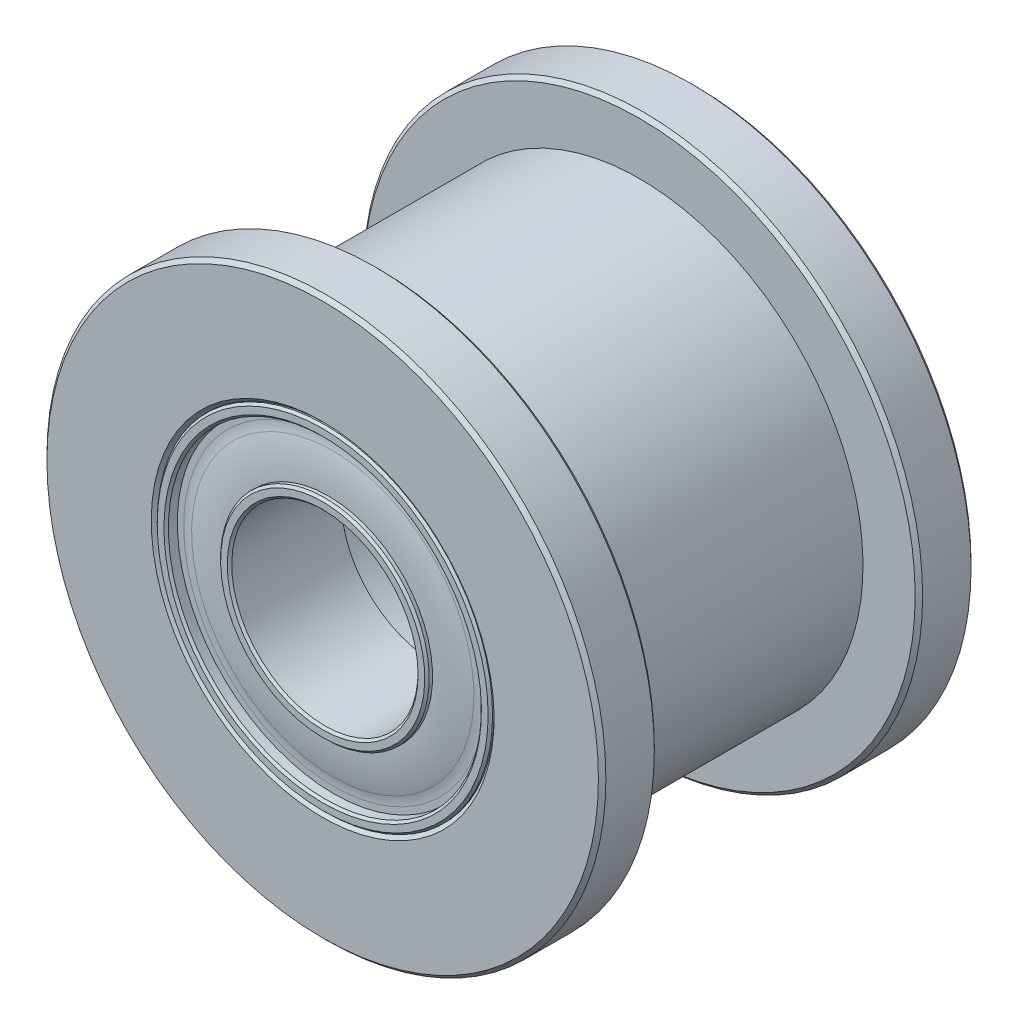
ISO-10303-21;
HEADER;
FILE_DESCRIPTION(('STEP AP214'),'2;1');
FILE_NAME('part.step','',(''),(''),'','','');
FILE_SCHEMA(('AUTOMOTIVE_DESIGN { 1 0 10303 214 1 1 1 1 }'));
ENDSEC;
DATA;
#1=APPLICATION_CONTEXT('core data for automotive mechanical design processes');
#2=APPLICATION_PROTOCOL_DEFINITION('international standard','automotive_design',2000,#1);
#3=PRODUCT_CONTEXT('',#1,'mechanical');
#4=PRODUCT('Part','Part','',(#3));
#5=PRODUCT_RELATED_PRODUCT_CATEGORY('part','',(#4));
#6=PRODUCT_DEFINITION_FORMATION('','',#4);
#7=PRODUCT_DEFINITION_CONTEXT('part definition',#1,'design');
#8=PRODUCT_DEFINITION('design','',#6,#7);
#9=PRODUCT_DEFINITION_SHAPE('','',#8);
#10=(LENGTH_UNIT() NAMED_UNIT(*) SI_UNIT(.MILLI.,.METRE.));
#11=(NAMED_UNIT(*) PLANE_ANGLE_UNIT() SI_UNIT($,.RADIAN.));
#12=(NAMED_UNIT(*) SI_UNIT($,.STERADIAN.) SOLID_ANGLE_UNIT());
#13=UNCERTAINTY_MEASURE_WITH_UNIT(LENGTH_MEASURE(1.E-05),#10,'distance_accuracy_value','');
#14=(GEOMETRIC_REPRESENTATION_CONTEXT(3) GLOBAL_UNCERTAINTY_ASSIGNED_CONTEXT((#13)) GLOBAL_UNIT_ASSIGNED_CONTEXT((#10,
#11,#12)) REPRESENTATION_CONTEXT('',''));
#15=CARTESIAN_POINT('',(0.,0.,0.));
#16=DIRECTION('',(0.,0.,1.));
#17=DIRECTION('',(1.,0.,0.));
#18=AXIS2_PLACEMENT_3D('',#15,#16,#17);
#19=CARTESIAN_POINT('',(0.,7.5,-3.5));
#20=DIRECTION('',(0.,0.,-1.));
#21=DIRECTION('',(0.,1.,0.));
#22=AXIS2_PLACEMENT_3D('',#19,#20,#21);
#23=PLANE('',#22);
#24=CARTESIAN_POINT('',(0.,0.,-3.5));
#25=DIRECTION('',(0.,0.,-1.));
#26=DIRECTION('',(0.,1.,0.));
#27=AXIS2_PLACEMENT_3D('',#24,#25,#26);
#28=CIRCLE('',#27,7.4);
#29=CARTESIAN_POINT('',(0.,7.4,-3.5));
#30=VERTEX_POINT('',#29);
#31=EDGE_CURVE('E88',#30,#30,#28,.F.);
#32=ORIENTED_EDGE('',*,*,#31,.T.);
#33=EDGE_LOOP('',(#32));
#34=FACE_BOUND('',#33,.T.);
#35=CARTESIAN_POINT('',(0.,0.,-3.5));
#36=DIRECTION('',(0.,0.,1.));
#37=DIRECTION('',(0.,-1.,0.));
#38=AXIS2_PLACEMENT_3D('',#35,#36,#37);
#39=CIRCLE('',#38,6.);
#40=CARTESIAN_POINT('',(0.,-6.,-3.5));
#41=VERTEX_POINT('',#40);
#42=EDGE_CURVE('E128',#41,#41,#39,.T.);
#43=ORIENTED_EDGE('',*,*,#42,.F.);
#44=EDGE_LOOP('',(#43));
#45=FACE_BOUND('',#44,.T.);
#46=ADVANCED_FACE('F52',(#34,#45),#23,.F.);
#47=CARTESIAN_POINT('',(0.,0.,5.));
#48=DIRECTION('',(0.,0.,1.));
#49=DIRECTION('',(0.,-1.,0.));
#50=AXIS2_PLACEMENT_3D('',#47,#48,#49);
#51=CYLINDRICAL_SURFACE('',#50,7.5);
#52=CARTESIAN_POINT('',(0.,0.,-4.9));
#53=DIRECTION('',(0.,0.,1.));
#54=DIRECTION('',(0.,-1.,0.));
#55=AXIS2_PLACEMENT_3D('',#52,#53,#54);
#56=CIRCLE('',#55,7.5);
#57=CARTESIAN_POINT('',(0.,-7.5,-4.9));
#58=VERTEX_POINT('',#57);
#59=EDGE_CURVE('E100',#58,#58,#56,.T.);
#60=ORIENTED_EDGE('',*,*,#59,.T.);
#61=EDGE_LOOP('',(#60));
#62=FACE_BOUND('',#61,.T.);
#63=CARTESIAN_POINT('',(0.,0.,-3.6));
#64=DIRECTION('',(0.,0.,-1.));
#65=DIRECTION('',(0.,1.,0.));
#66=AXIS2_PLACEMENT_3D('',#63,#64,#65);
#67=CIRCLE('',#66,7.5);
#68=CARTESIAN_POINT('',(0.,7.5,-3.6));
#69=VERTEX_POINT('',#68);
#70=EDGE_CURVE('E104',#69,#69,#67,.T.);
#71=ORIENTED_EDGE('',*,*,#70,.T.);
#72=EDGE_LOOP('',(#71));
#73=FACE_BOUND('',#72,.T.);
#74=ADVANCED_FACE('F136',(#62,#73),#51,.T.);
#75=CARTESIAN_POINT('',(0.,7.5,-5.));
#76=DIRECTION('',(0.,0.,1.));
#77=DIRECTION('',(0.,-1.,0.));
#78=AXIS2_PLACEMENT_3D('',#75,#76,#77);
#79=PLANE('',#78);
#80=CARTESIAN_POINT('',(0.,0.,-5.));
#81=DIRECTION('',(0.,0.,1.));
#82=DIRECTION('',(0.,-1.,0.));
#83=AXIS2_PLACEMENT_3D('',#80,#81,#82);
#84=CIRCLE('',#83,7.4);
#85=CARTESIAN_POINT('',(0.,-7.4,-5.));
#86=VERTEX_POINT('',#85);
#87=EDGE_CURVE('E92',#86,#86,#84,.F.);
#88=ORIENTED_EDGE('',*,*,#87,.T.);
#89=EDGE_LOOP('',(#88));
#90=FACE_BOUND('',#89,.T.);
#91=CARTESIAN_POINT('',(0.,0.,-5.));
#92=DIRECTION('',(0.,0.,1.));
#93=DIRECTION('',(0.,-1.,0.));
#94=AXIS2_PLACEMENT_3D('',#91,#92,#93);
#95=CIRCLE('',#94,4.6);
#96=CARTESIAN_POINT('',(0.,-4.6,-5.));
#97=VERTEX_POINT('',#96);
#98=EDGE_CURVE('E96',#97,#97,#95,.T.);
#99=ORIENTED_EDGE('',*,*,#98,.T.);
#100=EDGE_LOOP('',(#99));
#101=FACE_BOUND('',#100,.T.);
#102=ADVANCED_FACE('F143',(#90,#101),#79,.F.);
#103=CARTESIAN_POINT('',(0.,0.,5.));
#104=DIRECTION('',(0.,0.,1.));
#105=DIRECTION('',(0.,-1.,0.));
#106=AXIS2_PLACEMENT_3D('',#103,#104,#105);
#107=CYLINDRICAL_SURFACE('',#106,4.5);
#108=CARTESIAN_POINT('',(0.,0.,-4.9));
#109=DIRECTION('',(0.,0.,1.));
#110=DIRECTION('',(0.,-1.,0.));
#111=AXIS2_PLACEMENT_3D('',#108,#109,#110);
#112=CIRCLE('',#111,4.5);
#113=CARTESIAN_POINT('',(0.,-4.5,-4.9));
#114=VERTEX_POINT('',#113);
#115=EDGE_CURVE('E60',#114,#114,#112,.F.);
#116=ORIENTED_EDGE('',*,*,#115,.T.);
#117=EDGE_LOOP('',(#116));
#118=FACE_BOUND('',#117,.T.);
#119=CARTESIAN_POINT('',(0.,0.,-2.));
#120=DIRECTION('',(0.,0.,1.));
#121=DIRECTION('',(0.,-1.,0.));
#122=AXIS2_PLACEMENT_3D('',#119,#120,#121);
#123=CIRCLE('',#122,4.5);
#124=CARTESIAN_POINT('',(0.,-4.5,-2.));
#125=VERTEX_POINT('',#124);
#126=EDGE_CURVE('E108',#125,#125,#123,.T.);
#127=ORIENTED_EDGE('',*,*,#126,.T.);
#128=EDGE_LOOP('',(#127));
#129=FACE_BOUND('',#128,.T.);
#130=ADVANCED_FACE('F174',(#118,#129),#107,.F.);
#131=CARTESIAN_POINT('',(0.,3.5,-2.));
#132=DIRECTION('',(0.,0.,1.));
#133=DIRECTION('',(0.,-1.,0.));
#134=AXIS2_PLACEMENT_3D('',#131,#132,#133);
#135=PLANE('',#134);
#136=ORIENTED_EDGE('',*,*,#126,.F.);
#137=EDGE_LOOP('',(#136));
#138=FACE_BOUND('',#137,.T.);
#139=CARTESIAN_POINT('',(0.,0.,-2.));
#140=DIRECTION('',(0.,0.,1.));
#141=DIRECTION('',(0.,-1.,0.));
#142=AXIS2_PLACEMENT_3D('',#139,#140,#141);
#143=CIRCLE('',#142,3.5);
#144=CARTESIAN_POINT('',(0.,-3.5,-2.));
#145=VERTEX_POINT('',#144);
#146=EDGE_CURVE('E112',#145,#145,#143,.T.);
#147=ORIENTED_EDGE('',*,*,#146,.T.);
#148=EDGE_LOOP('',(#147));
#149=FACE_BOUND('',#148,.T.);
#150=ADVANCED_FACE('F179',(#138,#149),#135,.F.);
#151=CARTESIAN_POINT('',(0.,0.,5.));
#152=DIRECTION('',(0.,0.,1.));
#153=DIRECTION('',(0.,-1.,0.));
#154=AXIS2_PLACEMENT_3D('',#151,#152,#153);
#155=CYLINDRICAL_SURFACE('',#154,3.5);
#156=ORIENTED_EDGE('',*,*,#146,.F.);
#157=EDGE_LOOP('',(#156));
#158=FACE_BOUND('',#157,.T.);
#159=CARTESIAN_POINT('',(0.,0.,2.));
#160=DIRECTION('',(0.,0.,1.));
#161=DIRECTION('',(0.,-1.,0.));
#162=AXIS2_PLACEMENT_3D('',#159,#160,#161);
#163=CIRCLE('',#162,3.5);
#164=CARTESIAN_POINT('',(0.,-3.5,2.));
#165=VERTEX_POINT('',#164);
#166=EDGE_CURVE('E116',#165,#165,#163,.T.);
#167=ORIENTED_EDGE('',*,*,#166,.T.);
#168=EDGE_LOOP('',(#167));
#169=FACE_BOUND('',#168,.T.);
#170=ADVANCED_FACE('F184',(#158,#169),#155,.F.);
#171=CARTESIAN_POINT('',(0.,4.5,2.));
#172=DIRECTION('',(0.,0.,-1.));
#173=DIRECTION('',(0.,1.,0.));
#174=AXIS2_PLACEMENT_3D('',#171,#172,#173);
#175=PLANE('',#174);
#176=ORIENTED_EDGE('',*,*,#166,.F.);
#177=EDGE_LOOP('',(#176));
#178=FACE_BOUND('',#177,.T.);
#179=CARTESIAN_POINT('',(0.,0.,2.));
#180=DIRECTION('',(0.,0.,1.));
#181=DIRECTION('',(0.,-1.,0.));
#182=AXIS2_PLACEMENT_3D('',#179,#180,#181);
#183=CIRCLE('',#182,4.5);
#184=CARTESIAN_POINT('',(0.,-4.5,2.));
#185=VERTEX_POINT('',#184);
#186=EDGE_CURVE('E120',#185,#185,#183,.T.);
#187=ORIENTED_EDGE('',*,*,#186,.T.);
#188=EDGE_LOOP('',(#187));
#189=FACE_BOUND('',#188,.T.);
#190=ADVANCED_FACE('F188',(#178,#189),#175,.F.);
#191=CARTESIAN_POINT('',(0.,0.,5.));
#192=DIRECTION('',(0.,0.,1.));
#193=DIRECTION('',(0.,-1.,0.));
#194=AXIS2_PLACEMENT_3D('',#191,#192,#193);
#195=CYLINDRICAL_SURFACE('',#194,4.5);
#196=CARTESIAN_POINT('',(0.,0.,4.9));
#197=DIRECTION('',(0.,0.,-1.));
#198=DIRECTION('',(0.,1.,0.));
#199=AXIS2_PLACEMENT_3D('',#196,#197,#198);
#200=CIRCLE('',#199,4.5);
#201=CARTESIAN_POINT('',(0.,4.5,4.9));
#202=VERTEX_POINT('',#201);
#203=EDGE_CURVE('E11',#202,#202,#200,.F.);
#204=ORIENTED_EDGE('',*,*,#203,.T.);
#205=EDGE_LOOP('',(#204));
#206=FACE_BOUND('',#205,.T.);
#207=ORIENTED_EDGE('',*,*,#186,.F.);
#208=EDGE_LOOP('',(#207));
#209=FACE_BOUND('',#208,.T.);
#210=ADVANCED_FACE('F192',(#206,#209),#195,.F.);
#211=CARTESIAN_POINT('',(0.,7.5,5.));
#212=DIRECTION('',(0.,0.,-1.));
#213=DIRECTION('',(0.,1.,0.));
#214=AXIS2_PLACEMENT_3D('',#211,#212,#213);
#215=PLANE('',#214);
#216=CARTESIAN_POINT('',(0.,0.,5.));
#217=DIRECTION('',(0.,0.,-1.));
#218=DIRECTION('',(0.,1.,0.));
#219=AXIS2_PLACEMENT_3D('',#216,#217,#218);
#220=CIRCLE('',#219,7.4);
#221=CARTESIAN_POINT('',(0.,7.4,5.));
#222=VERTEX_POINT('',#221);
#223=EDGE_CURVE('E65',#222,#222,#220,.F.);
#224=ORIENTED_EDGE('',*,*,#223,.T.);
#225=EDGE_LOOP('',(#224));
#226=FACE_BOUND('',#225,.T.);
#227=CARTESIAN_POINT('',(0.,0.,5.));
#228=DIRECTION('',(0.,0.,-1.));
#229=DIRECTION('',(0.,1.,0.));
#230=AXIS2_PLACEMENT_3D('',#227,#228,#229);
#231=CIRCLE('',#230,4.6);
#232=CARTESIAN_POINT('',(0.,4.6,5.));
#233=VERTEX_POINT('',#232);
#234=EDGE_CURVE('E70',#233,#233,#231,.T.);
#235=ORIENTED_EDGE('',*,*,#234,.T.);
#236=EDGE_LOOP('',(#235));
#237=FACE_BOUND('',#236,.T.);
#238=ADVANCED_FACE('F196',(#226,#237),#215,.F.);
#239=CARTESIAN_POINT('',(0.,0.,5.));
#240=DIRECTION('',(0.,0.,1.));
#241=DIRECTION('',(0.,-1.,0.));
#242=AXIS2_PLACEMENT_3D('',#239,#240,#241);
#243=CYLINDRICAL_SURFACE('',#242,7.5);
#244=CARTESIAN_POINT('',(0.,0.,3.6));
#245=DIRECTION('',(0.,0.,1.));
#246=DIRECTION('',(0.,-1.,0.));
#247=AXIS2_PLACEMENT_3D('',#244,#245,#246);
#248=CIRCLE('',#247,7.5);
#249=CARTESIAN_POINT('',(0.,-7.5,3.6));
#250=VERTEX_POINT('',#249);
#251=EDGE_CURVE('E80',#250,#250,#248,.T.);
#252=ORIENTED_EDGE('',*,*,#251,.T.);
#253=EDGE_LOOP('',(#252));
#254=FACE_BOUND('',#253,.T.);
#255=CARTESIAN_POINT('',(0.,0.,4.9));
#256=DIRECTION('',(0.,0.,-1.));
#257=DIRECTION('',(0.,1.,0.));
#258=AXIS2_PLACEMENT_3D('',#255,#256,#257);
#259=CIRCLE('',#258,7.5);
#260=CARTESIAN_POINT('',(0.,7.5,4.9));
#261=VERTEX_POINT('',#260);
#262=EDGE_CURVE('E84',#261,#261,#259,.T.);
#263=ORIENTED_EDGE('',*,*,#262,.T.);
#264=EDGE_LOOP('',(#263));
#265=FACE_BOUND('',#264,.T.);
#266=ADVANCED_FACE('F199',(#254,#265),#243,.T.);
#267=CARTESIAN_POINT('',(0.,7.5,3.5));
#268=DIRECTION('',(0.,0.,1.));
#269=DIRECTION('',(0.,-1.,0.));
#270=AXIS2_PLACEMENT_3D('',#267,#268,#269);
#271=PLANE('',#270);
#272=CARTESIAN_POINT('',(0.,0.,3.5));
#273=DIRECTION('',(0.,0.,1.));
#274=DIRECTION('',(0.,-1.,0.));
#275=AXIS2_PLACEMENT_3D('',#272,#273,#274);
#276=CIRCLE('',#275,7.4);
#277=CARTESIAN_POINT('',(0.,-7.4,3.5));
#278=VERTEX_POINT('',#277);
#279=EDGE_CURVE('E76',#278,#278,#276,.F.);
#280=ORIENTED_EDGE('',*,*,#279,.T.);
#281=EDGE_LOOP('',(#280));
#282=FACE_BOUND('',#281,.T.);
#283=CARTESIAN_POINT('',(0.,0.,3.5));
#284=DIRECTION('',(0.,0.,1.));
#285=DIRECTION('',(0.,-1.,0.));
#286=AXIS2_PLACEMENT_3D('',#283,#284,#285);
#287=CIRCLE('',#286,6.);
#288=CARTESIAN_POINT('',(0.,-6.,3.5));
#289=VERTEX_POINT('',#288);
#290=EDGE_CURVE('E124',#289,#289,#287,.T.);
#291=ORIENTED_EDGE('',*,*,#290,.T.);
#292=EDGE_LOOP('',(#291));
#293=FACE_BOUND('',#292,.T.);
#294=ADVANCED_FACE('F203',(#282,#293),#271,.F.);
#295=CARTESIAN_POINT('',(0.,0.,5.));
#296=DIRECTION('',(0.,0.,1.));
#297=DIRECTION('',(0.,-1.,0.));
#298=AXIS2_PLACEMENT_3D('',#295,#296,#297);
#299=CYLINDRICAL_SURFACE('',#298,6.);
#300=ORIENTED_EDGE('',*,*,#290,.F.);
#301=EDGE_LOOP('',(#300));
#302=FACE_BOUND('',#301,.T.);
#303=ORIENTED_EDGE('',*,*,#42,.T.);
#304=EDGE_LOOP('',(#303));
#305=FACE_BOUND('',#304,.T.);
#306=ADVANCED_FACE('F133',(#302,#305),#299,.T.);
#307=CARTESIAN_POINT('',(0.,0.,-4.9));
#308=DIRECTION('',(0.,0.,1.));
#309=DIRECTION('',(0.,-1.,0.));
#310=AXIS2_PLACEMENT_3D('',#307,#308,#309);
#311=CONICAL_SURFACE('',#310,7.5,0.785398163397448);
#312=ORIENTED_EDGE('',*,*,#87,.F.);
#313=EDGE_LOOP('',(#312));
#314=FACE_BOUND('',#313,.T.);
#315=ORIENTED_EDGE('',*,*,#59,.F.);
#316=EDGE_LOOP('',(#315));
#317=FACE_BOUND('',#316,.T.);
#318=ADVANCED_FACE('F148',(#314,#317),#311,.T.);
#319=CARTESIAN_POINT('',(0.,0.,-3.5));
#320=DIRECTION('',(0.,0.,-1.));
#321=DIRECTION('',(0.,1.,0.));
#322=AXIS2_PLACEMENT_3D('',#319,#320,#321);
#323=CONICAL_SURFACE('',#322,7.4,0.785398163397457);
#324=ORIENTED_EDGE('',*,*,#70,.F.);
#325=EDGE_LOOP('',(#324));
#326=FACE_BOUND('',#325,.T.);
#327=ORIENTED_EDGE('',*,*,#31,.F.);
#328=EDGE_LOOP('',(#327));
#329=FACE_BOUND('',#328,.T.);
#330=ADVANCED_FACE('F151',(#326,#329),#323,.T.);
#331=CARTESIAN_POINT('',(0.,0.,3.6));
#332=DIRECTION('',(0.,0.,1.));
#333=DIRECTION('',(0.,-1.,0.));
#334=AXIS2_PLACEMENT_3D('',#331,#332,#333);
#335=CONICAL_SURFACE('',#334,7.5,0.785398163397453);
#336=ORIENTED_EDGE('',*,*,#279,.F.);
#337=EDGE_LOOP('',(#336));
#338=FACE_BOUND('',#337,.T.);
#339=ORIENTED_EDGE('',*,*,#251,.F.);
#340=EDGE_LOOP('',(#339));
#341=FACE_BOUND('',#340,.T.);
#342=ADVANCED_FACE('F155',(#338,#341),#335,.T.);
#343=CARTESIAN_POINT('',(0.,0.,5.));
#344=DIRECTION('',(0.,0.,-1.));
#345=DIRECTION('',(0.,1.,0.));
#346=AXIS2_PLACEMENT_3D('',#343,#344,#345);
#347=CONICAL_SURFACE('',#346,7.4,0.785398163397448);
#348=ORIENTED_EDGE('',*,*,#262,.F.);
#349=EDGE_LOOP('',(#348));
#350=FACE_BOUND('',#349,.T.);
#351=ORIENTED_EDGE('',*,*,#223,.F.);
#352=EDGE_LOOP('',(#351));
#353=FACE_BOUND('',#352,.T.);
#354=ADVANCED_FACE('F159',(#350,#353),#347,.T.);
#355=CARTESIAN_POINT('',(0.,0.,-5.));
#356=DIRECTION('',(0.,0.,-1.));
#357=DIRECTION('',(0.,1.,0.));
#358=AXIS2_PLACEMENT_3D('',#355,#356,#357);
#359=CONICAL_SURFACE('',#358,4.6,0.785398163397435);
#360=ORIENTED_EDGE('',*,*,#115,.F.);
#361=EDGE_LOOP('',(#360));
#362=FACE_BOUND('',#361,.T.);
#363=ORIENTED_EDGE('',*,*,#98,.F.);
#364=EDGE_LOOP('',(#363));
#365=FACE_BOUND('',#364,.T.);
#366=ADVANCED_FACE('F162',(#362,#365),#359,.F.);
#367=CARTESIAN_POINT('',(0.,0.,4.9));
#368=DIRECTION('',(0.,0.,1.));
#369=DIRECTION('',(0.,-1.,0.));
#370=AXIS2_PLACEMENT_3D('',#367,#368,#369);
#371=CONICAL_SURFACE('',#370,4.5,0.78539816339744);
#372=ORIENTED_EDGE('',*,*,#234,.F.);
#373=EDGE_LOOP('',(#372));
#374=FACE_BOUND('',#373,.T.);
#375=ORIENTED_EDGE('',*,*,#203,.F.);
#376=EDGE_LOOP('',(#375));
#377=FACE_BOUND('',#376,.T.);
#378=ADVANCED_FACE('F54',(#374,#377),#371,.F.);
#379=CLOSED_SHELL('',(#46,#74,#102,#130,#150,#170,#190,#210,#238,#266,#294,#306,#318,#330,#342,
#354,#366,#378));
#380=MANIFOLD_SOLID_BREP('B2',#379);
#381=CARTESIAN_POINT('',(0.,2.5,5.));
#382=DIRECTION('',(0.,0.,-1.));
#383=DIRECTION('',(0.,-1.,0.));
#384=AXIS2_PLACEMENT_3D('',#381,#382,#383);
#385=PLANE('',#384);
#386=CARTESIAN_POINT('',(0.,0.,5.));
#387=DIRECTION('',(0.,0.,1.));
#388=DIRECTION('',(0.,-1.,0.));
#389=AXIS2_PLACEMENT_3D('',#386,#387,#388);
#390=CIRCLE('',#389,2.74);
#391=CARTESIAN_POINT('',(0.,-2.74,5.));
#392=VERTEX_POINT('',#391);
#393=EDGE_CURVE('E342',#392,#392,#390,.F.);
#394=ORIENTED_EDGE('',*,*,#393,.F.);
#395=EDGE_LOOP('',(#394));
#396=FACE_BOUND('',#395,.T.);
#397=CARTESIAN_POINT('',(0.,0.,5.));
#398=DIRECTION('',(0.,0.,1.));
#399=DIRECTION('',(0.,-1.,0.));
#400=AXIS2_PLACEMENT_3D('',#397,#398,#399);
#401=CIRCLE('',#400,2.56);
#402=CARTESIAN_POINT('',(0.,-2.56,5.));
#403=VERTEX_POINT('',#402);
#404=EDGE_CURVE('E345',#403,#403,#401,.T.);
#405=ORIENTED_EDGE('',*,*,#404,.F.);
#406=EDGE_LOOP('',(#405));
#407=FACE_BOUND('',#406,.T.);
#408=ADVANCED_FACE('F313',(#396,#407),#385,.F.);
#409=CARTESIAN_POINT('',(0.,0.,-5.));
#410=DIRECTION('',(0.,0.,-1.));
#411=DIRECTION('',(0.,-1.,0.));
#412=AXIS2_PLACEMENT_3D('',#409,#410,#411);
#413=CYLINDRICAL_SURFACE('',#412,2.5);
#414=CARTESIAN_POINT('',(0.,0.,4.94));
#415=DIRECTION('',(0.,0.,1.));
#416=DIRECTION('',(0.,-1.,0.));
#417=AXIS2_PLACEMENT_3D('',#414,#415,#416);
#418=CIRCLE('',#417,2.5);
#419=CARTESIAN_POINT('',(0.,-2.5,4.94));
#420=VERTEX_POINT('',#419);
#421=EDGE_CURVE('E339',#420,#420,#418,.F.);
#422=ORIENTED_EDGE('',*,*,#421,.F.);
#423=EDGE_LOOP('',(#422));
#424=FACE_BOUND('',#423,.T.);
#425=CARTESIAN_POINT('',(0.,0.,2.));
#426=DIRECTION('',(0.,0.,1.));
#427=DIRECTION('',(0.,-1.,0.));
#428=AXIS2_PLACEMENT_3D('',#425,#426,#427);
#429=CIRCLE('',#428,2.5);
#430=CARTESIAN_POINT('',(0.,-2.5,2.));
#431=VERTEX_POINT('',#430);
#432=EDGE_CURVE('E351',#431,#431,#429,.T.);
#433=ORIENTED_EDGE('',*,*,#432,.F.);
#434=EDGE_LOOP('',(#433));
#435=FACE_BOUND('',#434,.T.);
#436=ADVANCED_FACE('F382',(#424,#435),#413,.F.);
#437=CARTESIAN_POINT('',(0.,4.5,2.));
#438=DIRECTION('',(0.,0.,1.));
#439=DIRECTION('',(0.,1.,0.));
#440=AXIS2_PLACEMENT_3D('',#437,#438,#439);
#441=PLANE('',#440);
#442=ORIENTED_EDGE('',*,*,#432,.T.);
#443=EDGE_LOOP('',(#442));
#444=FACE_BOUND('',#443,.T.);
#445=CARTESIAN_POINT('',(0.,0.,2.));
#446=DIRECTION('',(0.,0.,1.));
#447=DIRECTION('',(0.,-1.,0.));
#448=AXIS2_PLACEMENT_3D('',#445,#446,#447);
#449=CIRCLE('',#448,4.5);
#450=CARTESIAN_POINT('',(0.,-4.5,2.));
#451=VERTEX_POINT('',#450);
#452=EDGE_CURVE('E354',#451,#451,#449,.T.);
#453=ORIENTED_EDGE('',*,*,#452,.F.);
#454=EDGE_LOOP('',(#453));
#455=FACE_BOUND('',#454,.T.);
#456=ADVANCED_FACE('F388',(#444,#455),#441,.F.);
#457=CARTESIAN_POINT('',(0.,0.,-5.));
#458=DIRECTION('',(0.,0.,-1.));
#459=DIRECTION('',(0.,-1.,0.));
#460=AXIS2_PLACEMENT_3D('',#457,#458,#459);
#461=CYLINDRICAL_SURFACE('',#460,4.5);
#462=CARTESIAN_POINT('',(0.,0.,4.94));
#463=DIRECTION('',(0.,0.,1.));
#464=DIRECTION('',(0.,-1.,0.));
#465=AXIS2_PLACEMENT_3D('',#462,#463,#464);
#466=CIRCLE('',#465,4.5);
#467=CARTESIAN_POINT('',(0.,-4.5,4.94));
#468=VERTEX_POINT('',#467);
#469=EDGE_CURVE('E324',#468,#468,#466,.T.);
#470=ORIENTED_EDGE('',*,*,#469,.F.);
#471=EDGE_LOOP('',(#470));
#472=FACE_BOUND('',#471,.T.);
#473=ORIENTED_EDGE('',*,*,#452,.T.);
#474=EDGE_LOOP('',(#473));
#475=FACE_BOUND('',#474,.T.);
#476=ADVANCED_FACE('F415',(#472,#475),#461,.T.);
#477=CARTESIAN_POINT('',(0.,4.5,5.));
#478=DIRECTION('',(0.,0.,-1.));
#479=DIRECTION('',(0.,-1.,0.));
#480=AXIS2_PLACEMENT_3D('',#477,#478,#479);
#481=PLANE('',#480);
#482=CARTESIAN_POINT('',(0.,0.,5.));
#483=DIRECTION('',(0.,0.,1.));
#484=DIRECTION('',(0.,-1.,0.));
#485=AXIS2_PLACEMENT_3D('',#482,#483,#484);
#486=CIRCLE('',#485,4.26);
#487=CARTESIAN_POINT('',(0.,-4.26,5.));
#488=VERTEX_POINT('',#487);
#489=EDGE_CURVE('E333',#488,#488,#486,.T.);
#490=ORIENTED_EDGE('',*,*,#489,.F.);
#491=EDGE_LOOP('',(#490));
#492=FACE_BOUND('',#491,.T.);
#493=CARTESIAN_POINT('',(0.,0.,5.));
#494=DIRECTION('',(0.,0.,1.));
#495=DIRECTION('',(0.,-1.,0.));
#496=AXIS2_PLACEMENT_3D('',#493,#494,#495);
#497=CIRCLE('',#496,4.44);
#498=CARTESIAN_POINT('',(0.,-4.44,5.));
#499=VERTEX_POINT('',#498);
#500=EDGE_CURVE('E336',#499,#499,#497,.F.);
#501=ORIENTED_EDGE('',*,*,#500,.F.);
#502=EDGE_LOOP('',(#501));
#503=FACE_BOUND('',#502,.T.);
#504=ADVANCED_FACE('F418',(#492,#503),#481,.F.);
#505=CARTESIAN_POINT('',(0.,0.,-5.));
#506=DIRECTION('',(0.,0.,-1.));
#507=DIRECTION('',(0.,-1.,0.));
#508=AXIS2_PLACEMENT_3D('',#505,#506,#507);
#509=CYLINDRICAL_SURFACE('',#508,4.2);
#510=CARTESIAN_POINT('',(0.,0.,4.94));
#511=DIRECTION('',(0.,0.,1.));
#512=DIRECTION('',(0.,-1.,0.));
#513=AXIS2_PLACEMENT_3D('',#510,#511,#512);
#514=CIRCLE('',#513,4.2);
#515=CARTESIAN_POINT('',(0.,-4.2,4.94));
#516=VERTEX_POINT('',#515);
#517=EDGE_CURVE('E328',#516,#516,#514,.F.);
#518=ORIENTED_EDGE('',*,*,#517,.F.);
#519=EDGE_LOOP('',(#518));
#520=FACE_BOUND('',#519,.T.);
#521=CARTESIAN_POINT('',(0.,0.,4.7));
#522=DIRECTION('',(0.,0.,1.));
#523=DIRECTION('',(0.,-1.,0.));
#524=AXIS2_PLACEMENT_3D('',#521,#522,#523);
#525=CIRCLE('',#524,4.2);
#526=CARTESIAN_POINT('',(0.,-4.2,4.7));
#527=VERTEX_POINT('',#526);
#528=EDGE_CURVE('E357',#527,#527,#525,.T.);
#529=ORIENTED_EDGE('',*,*,#528,.F.);
#530=EDGE_LOOP('',(#529));
#531=FACE_BOUND('',#530,.T.);
#532=ADVANCED_FACE('F378',(#520,#531),#509,.F.);
#533=CARTESIAN_POINT('',(0.,3.9,4.7));
#534=DIRECTION('',(0.,0.,-1.));
#535=DIRECTION('',(0.,-1.,0.));
#536=AXIS2_PLACEMENT_3D('',#533,#534,#535);
#537=PLANE('',#536);
#538=CARTESIAN_POINT('',(0.,0.,4.7));
#539=DIRECTION('',(0.,0.,1.));
#540=DIRECTION('',(0.,-1.,0.));
#541=AXIS2_PLACEMENT_3D('',#538,#539,#540);
#542=CIRCLE('',#541,4.02882057274445);
#543=CARTESIAN_POINT('',(0.,-4.02882057274445,4.7));
#544=VERTEX_POINT('',#543);
#545=EDGE_CURVE('E320',#544,#544,#542,.T.);
#546=ORIENTED_EDGE('',*,*,#545,.F.);
#547=EDGE_LOOP('',(#546));
#548=FACE_BOUND('',#547,.T.);
#549=ORIENTED_EDGE('',*,*,#528,.T.);
#550=EDGE_LOOP('',(#549));
#551=FACE_BOUND('',#550,.T.);
#552=ADVANCED_FACE('F368',(#548,#551),#537,.F.);
#553=CARTESIAN_POINT('',(0.,0.,0.741666666666619));
#554=DIRECTION('',(0.,0.,-1.));
#555=DIRECTION('',(0.,-1.,0.));
#556=AXIS2_PLACEMENT_3D('',#553,#554,#555);
#557=DEGENERATE_TOROIDAL_SURFACE('',#556,2.8,4.10833333333338,.T.);
#558=CARTESIAN_POINT('',(0.,0.,4.72936378466557));
#559=DIRECTION('',(0.,0.,1.));
#560=DIRECTION('',(0.,-1.,0.));
#561=AXIS2_PLACEMENT_3D('',#558,#559,#560);
#562=CIRCLE('',#561,3.78826842147311);
#563=CARTESIAN_POINT('',(0.,-3.78826842147311,4.72936378466557));
#564=VERTEX_POINT('',#563);
#565=EDGE_CURVE('E51',#564,#564,#562,.F.);
#566=ORIENTED_EDGE('',*,*,#565,.F.);
#567=EDGE_LOOP('',(#566));
#568=FACE_BOUND('',#567,.T.);
#569=CARTESIAN_POINT('',(0.,0.,4.85));
#570=DIRECTION('',(0.,0.,1.));
#571=DIRECTION('',(0.,-1.,0.));
#572=AXIS2_PLACEMENT_3D('',#569,#570,#571);
#573=CIRCLE('',#572,2.8);
#574=CARTESIAN_POINT('',(0.,-2.8,4.85));
#575=VERTEX_POINT('',#574);
#576=EDGE_CURVE('E360',#575,#575,#573,.T.);
#577=ORIENTED_EDGE('',*,*,#576,.F.);
#578=EDGE_LOOP('',(#577));
#579=FACE_BOUND('',#578,.T.);
#580=ADVANCED_FACE('F366',(#568,#579),#557,.T.);
#581=CARTESIAN_POINT('',(0.,0.,-5.));
#582=DIRECTION('',(0.,0.,-1.));
#583=DIRECTION('',(0.,-1.,0.));
#584=AXIS2_PLACEMENT_3D('',#581,#582,#583);
#585=CYLINDRICAL_SURFACE('',#584,2.8);
#586=CARTESIAN_POINT('',(0.,0.,4.94));
#587=DIRECTION('',(0.,0.,1.));
#588=DIRECTION('',(0.,-1.,0.));
#589=AXIS2_PLACEMENT_3D('',#586,#587,#588);
#590=CIRCLE('',#589,2.8);
#591=CARTESIAN_POINT('',(0.,-2.8,4.94));
#592=VERTEX_POINT('',#591);
#593=EDGE_CURVE('E348',#592,#592,#590,.T.);
#594=ORIENTED_EDGE('',*,*,#593,.F.);
#595=EDGE_LOOP('',(#594));
#596=FACE_BOUND('',#595,.T.);
#597=ORIENTED_EDGE('',*,*,#576,.T.);
#598=EDGE_LOOP('',(#597));
#599=FACE_BOUND('',#598,.T.);
#600=ADVANCED_FACE('F364',(#596,#599),#585,.T.);
#601=CARTESIAN_POINT('',(0.,0.,4.94));
#602=DIRECTION('',(0.,0.,-1.));
#603=DIRECTION('',(0.,-1.,0.));
#604=AXIS2_PLACEMENT_3D('',#601,#602,#603);
#605=CONICAL_SURFACE('',#604,2.8,0.785398163397434);
#606=ORIENTED_EDGE('',*,*,#393,.T.);
#607=EDGE_LOOP('',(#606));
#608=FACE_BOUND('',#607,.T.);
#609=ORIENTED_EDGE('',*,*,#593,.T.);
#610=EDGE_LOOP('',(#609));
#611=FACE_BOUND('',#610,.T.);
#612=ADVANCED_FACE('F375',(#608,#611),#605,.T.);
#613=CARTESIAN_POINT('',(0.,0.,5.));
#614=DIRECTION('',(0.,0.,1.));
#615=DIRECTION('',(0.,1.,0.));
#616=AXIS2_PLACEMENT_3D('',#613,#614,#615);
#617=CONICAL_SURFACE('',#616,2.56,0.785398163397445);
#618=ORIENTED_EDGE('',*,*,#421,.T.);
#619=EDGE_LOOP('',(#618));
#620=FACE_BOUND('',#619,.T.);
#621=ORIENTED_EDGE('',*,*,#404,.T.);
#622=EDGE_LOOP('',(#621));
#623=FACE_BOUND('',#622,.T.);
#624=ADVANCED_FACE('F397',(#620,#623),#617,.F.);
#625=CARTESIAN_POINT('',(0.,0.,5.));
#626=DIRECTION('',(0.,0.,1.));
#627=DIRECTION('',(0.,1.,0.));
#628=AXIS2_PLACEMENT_3D('',#625,#626,#627);
#629=CONICAL_SURFACE('',#628,4.26,0.785398163397434);
#630=ORIENTED_EDGE('',*,*,#517,.T.);
#631=EDGE_LOOP('',(#630));
#632=FACE_BOUND('',#631,.T.);
#633=ORIENTED_EDGE('',*,*,#489,.T.);
#634=EDGE_LOOP('',(#633));
#635=FACE_BOUND('',#634,.T.);
#636=ADVANCED_FACE('F401',(#632,#635),#629,.F.);
#637=CARTESIAN_POINT('',(0.,0.,4.94));
#638=DIRECTION('',(0.,0.,-1.));
#639=DIRECTION('',(0.,-1.,0.));
#640=AXIS2_PLACEMENT_3D('',#637,#638,#639);
#641=CONICAL_SURFACE('',#640,4.5,0.785398163397441);
#642=ORIENTED_EDGE('',*,*,#500,.T.);
#643=EDGE_LOOP('',(#642));
#644=FACE_BOUND('',#643,.T.);
#645=ORIENTED_EDGE('',*,*,#469,.T.);
#646=EDGE_LOOP('',(#645));
#647=FACE_BOUND('',#646,.T.);
#648=ADVANCED_FACE('F404',(#644,#647),#641,.T.);
#649=CARTESIAN_POINT('',(0.,0.,5.7));
#650=DIRECTION('',(0.,0.,-1.));
#651=DIRECTION('',(0.,-1.,0.));
#652=AXIS2_PLACEMENT_3D('',#649,#650,#651);
#653=TOROIDAL_SURFACE('',#652,4.02882057274445,1.);
#654=ORIENTED_EDGE('',*,*,#565,.T.);
#655=EDGE_LOOP('',(#654));
#656=FACE_BOUND('',#655,.T.);
#657=ORIENTED_EDGE('',*,*,#545,.T.);
#658=EDGE_LOOP('',(#657));
#659=FACE_BOUND('',#658,.T.);
#660=ADVANCED_FACE('F315',(#656,#659),#653,.F.);
#661=CLOSED_SHELL('',(#408,#436,#456,#476,#504,#532,#552,#580,#600,#612,#624,#636,#648,#660));
#662=MANIFOLD_SOLID_BREP('B6',#661);
#663=CARTESIAN_POINT('',(0.,2.5,-5.));
#664=DIRECTION('',(0.,0.,1.));
#665=DIRECTION('',(0.,-1.,0.));
#666=AXIS2_PLACEMENT_3D('',#663,#664,#665);
#667=PLANE('',#666);
#668=CARTESIAN_POINT('',(0.,0.,-5.));
#669=DIRECTION('',(0.,0.,1.));
#670=DIRECTION('',(0.,-1.,0.));
#671=AXIS2_PLACEMENT_3D('',#668,#669,#670);
#672=CIRCLE('',#671,2.74);
#673=CARTESIAN_POINT('',(0.,-2.74,-5.));
#674=VERTEX_POINT('',#673);
#675=EDGE_CURVE('E573',#674,#674,#672,.F.);
#676=ORIENTED_EDGE('',*,*,#675,.T.);
#677=EDGE_LOOP('',(#676));
#678=FACE_BOUND('',#677,.T.);
#679=CARTESIAN_POINT('',(0.,0.,-5.));
#680=DIRECTION('',(0.,0.,1.));
#681=DIRECTION('',(0.,-1.,0.));
#682=AXIS2_PLACEMENT_3D('',#679,#680,#681);
#683=CIRCLE('',#682,2.56);
#684=CARTESIAN_POINT('',(0.,-2.56,-5.));
#685=VERTEX_POINT('',#684);
#686=EDGE_CURVE('E576',#685,#685,#683,.T.);
#687=ORIENTED_EDGE('',*,*,#686,.T.);
#688=EDGE_LOOP('',(#687));
#689=FACE_BOUND('',#688,.T.);
#690=ADVANCED_FACE('F544',(#678,#689),#667,.F.);
#691=CARTESIAN_POINT('',(0.,0.,5.));
#692=DIRECTION('',(0.,0.,1.));
#693=DIRECTION('',(0.,-1.,0.));
#694=AXIS2_PLACEMENT_3D('',#691,#692,#693);
#695=CYLINDRICAL_SURFACE('',#694,2.5);
#696=CARTESIAN_POINT('',(0.,0.,-4.94));
#697=DIRECTION('',(0.,0.,1.));
#698=DIRECTION('',(0.,-1.,0.));
#699=AXIS2_PLACEMENT_3D('',#696,#697,#698);
#700=CIRCLE('',#699,2.5);
#701=CARTESIAN_POINT('',(0.,-2.5,-4.94));
#702=VERTEX_POINT('',#701);
#703=EDGE_CURVE('E570',#702,#702,#700,.F.);
#704=ORIENTED_EDGE('',*,*,#703,.T.);
#705=EDGE_LOOP('',(#704));
#706=FACE_BOUND('',#705,.T.);
#707=CARTESIAN_POINT('',(0.,0.,-2.));
#708=DIRECTION('',(0.,0.,1.));
#709=DIRECTION('',(0.,-1.,0.));
#710=AXIS2_PLACEMENT_3D('',#707,#708,#709);
#711=CIRCLE('',#710,2.5);
#712=CARTESIAN_POINT('',(0.,-2.5,-2.));
#713=VERTEX_POINT('',#712);
#714=EDGE_CURVE('E582',#713,#713,#711,.T.);
#715=ORIENTED_EDGE('',*,*,#714,.T.);
#716=EDGE_LOOP('',(#715));
#717=FACE_BOUND('',#716,.T.);
#718=ADVANCED_FACE('F613',(#706,#717),#695,.F.);
#719=CARTESIAN_POINT('',(0.,4.5,-2.));
#720=DIRECTION('',(0.,0.,-1.));
#721=DIRECTION('',(0.,1.,0.));
#722=AXIS2_PLACEMENT_3D('',#719,#720,#721);
#723=PLANE('',#722);
#724=ORIENTED_EDGE('',*,*,#714,.F.);
#725=EDGE_LOOP('',(#724));
#726=FACE_BOUND('',#725,.T.);
#727=CARTESIAN_POINT('',(0.,0.,-2.));
#728=DIRECTION('',(0.,0.,1.));
#729=DIRECTION('',(0.,-1.,0.));
#730=AXIS2_PLACEMENT_3D('',#727,#728,#729);
#731=CIRCLE('',#730,4.5);
#732=CARTESIAN_POINT('',(0.,-4.5,-2.));
#733=VERTEX_POINT('',#732);
#734=EDGE_CURVE('E585',#733,#733,#731,.T.);
#735=ORIENTED_EDGE('',*,*,#734,.T.);
#736=EDGE_LOOP('',(#735));
#737=FACE_BOUND('',#736,.T.);
#738=ADVANCED_FACE('F620',(#726,#737),#723,.F.);
#739=CARTESIAN_POINT('',(0.,0.,5.));
#740=DIRECTION('',(0.,0.,1.));
#741=DIRECTION('',(0.,-1.,0.));
#742=AXIS2_PLACEMENT_3D('',#739,#740,#741);
#743=CYLINDRICAL_SURFACE('',#742,4.5);
#744=CARTESIAN_POINT('',(0.,0.,-4.94));
#745=DIRECTION('',(0.,0.,1.));
#746=DIRECTION('',(0.,-1.,0.));
#747=AXIS2_PLACEMENT_3D('',#744,#745,#746);
#748=CIRCLE('',#747,4.5);
#749=CARTESIAN_POINT('',(0.,-4.5,-4.94));
#750=VERTEX_POINT('',#749);
#751=EDGE_CURVE('E555',#750,#750,#748,.T.);
#752=ORIENTED_EDGE('',*,*,#751,.T.);
#753=EDGE_LOOP('',(#752));
#754=FACE_BOUND('',#753,.T.);
#755=ORIENTED_EDGE('',*,*,#734,.F.);
#756=EDGE_LOOP('',(#755));
#757=FACE_BOUND('',#756,.T.);
#758=ADVANCED_FACE('F644',(#754,#757),#743,.T.);
#759=CARTESIAN_POINT('',(0.,4.5,-5.));
#760=DIRECTION('',(0.,0.,1.));
#761=DIRECTION('',(0.,-1.,0.));
#762=AXIS2_PLACEMENT_3D('',#759,#760,#761);
#763=PLANE('',#762);
#764=CARTESIAN_POINT('',(0.,0.,-5.));
#765=DIRECTION('',(0.,0.,1.));
#766=DIRECTION('',(0.,-1.,0.));
#767=AXIS2_PLACEMENT_3D('',#764,#765,#766);
#768=CIRCLE('',#767,4.26);
#769=CARTESIAN_POINT('',(0.,-4.26,-5.));
#770=VERTEX_POINT('',#769);
#771=EDGE_CURVE('E564',#770,#770,#768,.T.);
#772=ORIENTED_EDGE('',*,*,#771,.T.);
#773=EDGE_LOOP('',(#772));
#774=FACE_BOUND('',#773,.T.);
#775=CARTESIAN_POINT('',(0.,0.,-5.));
#776=DIRECTION('',(0.,0.,1.));
#777=DIRECTION('',(0.,-1.,0.));
#778=AXIS2_PLACEMENT_3D('',#775,#776,#777);
#779=CIRCLE('',#778,4.44);
#780=CARTESIAN_POINT('',(0.,-4.44,-5.));
#781=VERTEX_POINT('',#780);
#782=EDGE_CURVE('E567',#781,#781,#779,.F.);
#783=ORIENTED_EDGE('',*,*,#782,.T.);
#784=EDGE_LOOP('',(#783));
#785=FACE_BOUND('',#784,.T.);
#786=ADVANCED_FACE('F647',(#774,#785),#763,.F.);
#787=CARTESIAN_POINT('',(0.,0.,5.));
#788=DIRECTION('',(0.,0.,1.));
#789=DIRECTION('',(0.,-1.,0.));
#790=AXIS2_PLACEMENT_3D('',#787,#788,#789);
#791=CYLINDRICAL_SURFACE('',#790,4.2);
#792=CARTESIAN_POINT('',(0.,0.,-4.94));
#793=DIRECTION('',(0.,0.,1.));
#794=DIRECTION('',(0.,-1.,0.));
#795=AXIS2_PLACEMENT_3D('',#792,#793,#794);
#796=CIRCLE('',#795,4.2);
#797=CARTESIAN_POINT('',(0.,-4.2,-4.94));
#798=VERTEX_POINT('',#797);
#799=EDGE_CURVE('E559',#798,#798,#796,.F.);
#800=ORIENTED_EDGE('',*,*,#799,.T.);
#801=EDGE_LOOP('',(#800));
#802=FACE_BOUND('',#801,.T.);
#803=CARTESIAN_POINT('',(0.,0.,-4.7));
#804=DIRECTION('',(0.,0.,1.));
#805=DIRECTION('',(0.,-1.,0.));
#806=AXIS2_PLACEMENT_3D('',#803,#804,#805);
#807=CIRCLE('',#806,4.2);
#808=CARTESIAN_POINT('',(0.,-4.2,-4.7));
#809=VERTEX_POINT('',#808);
#810=EDGE_CURVE('E588',#809,#809,#807,.T.);
#811=ORIENTED_EDGE('',*,*,#810,.T.);
#812=EDGE_LOOP('',(#811));
#813=FACE_BOUND('',#812,.T.);
#814=ADVANCED_FACE('F658',(#802,#813),#791,.F.);
#815=CARTESIAN_POINT('',(0.,3.9,-4.7));
#816=DIRECTION('',(0.,0.,1.));
#817=DIRECTION('',(0.,-1.,0.));
#818=AXIS2_PLACEMENT_3D('',#815,#816,#817);
#819=PLANE('',#818);
#820=CARTESIAN_POINT('',(0.,0.,-4.7));
#821=DIRECTION('',(0.,0.,1.));
#822=DIRECTION('',(0.,-1.,0.));
#823=AXIS2_PLACEMENT_3D('',#820,#821,#822);
#824=CIRCLE('',#823,4.02882057274445);
#825=CARTESIAN_POINT('',(0.,-4.02882057274445,-4.7));
#826=VERTEX_POINT('',#825);
#827=EDGE_CURVE('E551',#826,#826,#824,.T.);
#828=ORIENTED_EDGE('',*,*,#827,.T.);
#829=EDGE_LOOP('',(#828));
#830=FACE_BOUND('',#829,.T.);
#831=ORIENTED_EDGE('',*,*,#810,.F.);
#832=EDGE_LOOP('',(#831));
#833=FACE_BOUND('',#832,.T.);
#834=ADVANCED_FACE('F610',(#830,#833),#819,.F.);
#835=CARTESIAN_POINT('',(0.,0.,-0.741666666666619));
#836=DIRECTION('',(0.,0.,1.));
#837=DIRECTION('',(0.,-1.,0.));
#838=AXIS2_PLACEMENT_3D('',#835,#836,#837);
#839=DEGENERATE_TOROIDAL_SURFACE('',#838,2.8,4.10833333333338,.T.);
#840=CARTESIAN_POINT('',(0.,0.,-4.72936378466557));
#841=DIRECTION('',(0.,0.,1.));
#842=DIRECTION('',(0.,-1.,0.));
#843=AXIS2_PLACEMENT_3D('',#840,#841,#842);
#844=CIRCLE('',#843,3.78826842147311);
#845=CARTESIAN_POINT('',(0.,-3.78826842147311,-4.72936378466557));
#846=VERTEX_POINT('',#845);
#847=EDGE_CURVE('E312',#846,#846,#844,.F.);
#848=ORIENTED_EDGE('',*,*,#847,.T.);
#849=EDGE_LOOP('',(#848));
#850=FACE_BOUND('',#849,.T.);
#851=CARTESIAN_POINT('',(0.,0.,-4.85));
#852=DIRECTION('',(0.,0.,1.));
#853=DIRECTION('',(0.,-1.,0.));
#854=AXIS2_PLACEMENT_3D('',#851,#852,#853);
#855=CIRCLE('',#854,2.8);
#856=CARTESIAN_POINT('',(0.,-2.8,-4.85));
#857=VERTEX_POINT('',#856);
#858=EDGE_CURVE('E591',#857,#857,#855,.T.);
#859=ORIENTED_EDGE('',*,*,#858,.T.);
#860=EDGE_LOOP('',(#859));
#861=FACE_BOUND('',#860,.T.);
#862=ADVANCED_FACE('F595',(#850,#861),#839,.T.);
#863=CARTESIAN_POINT('',(0.,0.,5.));
#864=DIRECTION('',(0.,0.,1.));
#865=DIRECTION('',(0.,-1.,0.));
#866=AXIS2_PLACEMENT_3D('',#863,#864,#865);
#867=CYLINDRICAL_SURFACE('',#866,2.8);
#868=CARTESIAN_POINT('',(0.,0.,-4.94));
#869=DIRECTION('',(0.,0.,1.));
#870=DIRECTION('',(0.,-1.,0.));
#871=AXIS2_PLACEMENT_3D('',#868,#869,#870);
#872=CIRCLE('',#871,2.8);
#873=CARTESIAN_POINT('',(0.,-2.8,-4.94));
#874=VERTEX_POINT('',#873);
#875=EDGE_CURVE('E579',#874,#874,#872,.T.);
#876=ORIENTED_EDGE('',*,*,#875,.T.);
#877=EDGE_LOOP('',(#876));
#878=FACE_BOUND('',#877,.T.);
#879=ORIENTED_EDGE('',*,*,#858,.F.);
#880=EDGE_LOOP('',(#879));
#881=FACE_BOUND('',#880,.T.);
#882=ADVANCED_FACE('F597',(#878,#881),#867,.T.);
#883=CARTESIAN_POINT('',(0.,0.,-4.94));
#884=DIRECTION('',(0.,0.,1.));
#885=DIRECTION('',(0.,-1.,0.));
#886=AXIS2_PLACEMENT_3D('',#883,#884,#885);
#887=CONICAL_SURFACE('',#886,2.8,0.785398163397434);
#888=ORIENTED_EDGE('',*,*,#675,.F.);
#889=EDGE_LOOP('',(#888));
#890=FACE_BOUND('',#889,.T.);
#891=ORIENTED_EDGE('',*,*,#875,.F.);
#892=EDGE_LOOP('',(#891));
#893=FACE_BOUND('',#892,.T.);
#894=ADVANCED_FACE('F599',(#890,#893),#887,.T.);
#895=CARTESIAN_POINT('',(0.,0.,-5.));
#896=DIRECTION('',(0.,0.,-1.));
#897=DIRECTION('',(0.,1.,0.));
#898=AXIS2_PLACEMENT_3D('',#895,#896,#897);
#899=CONICAL_SURFACE('',#898,2.56,0.785398163397445);
#900=ORIENTED_EDGE('',*,*,#703,.F.);
#901=EDGE_LOOP('',(#900));
#902=FACE_BOUND('',#901,.T.);
#903=ORIENTED_EDGE('',*,*,#686,.F.);
#904=EDGE_LOOP('',(#903));
#905=FACE_BOUND('',#904,.T.);
#906=ADVANCED_FACE('F606',(#902,#905),#899,.F.);
#907=CARTESIAN_POINT('',(0.,0.,-5.));
#908=DIRECTION('',(0.,0.,-1.));
#909=DIRECTION('',(0.,1.,0.));
#910=AXIS2_PLACEMENT_3D('',#907,#908,#909);
#911=CONICAL_SURFACE('',#910,4.26,0.785398163397434);
#912=ORIENTED_EDGE('',*,*,#799,.F.);
#913=EDGE_LOOP('',(#912));
#914=FACE_BOUND('',#913,.T.);
#915=ORIENTED_EDGE('',*,*,#771,.F.);
#916=EDGE_LOOP('',(#915));
#917=FACE_BOUND('',#916,.T.);
#918=ADVANCED_FACE('F628',(#914,#917),#911,.F.);
#919=CARTESIAN_POINT('',(0.,0.,-4.94));
#920=DIRECTION('',(0.,0.,1.));
#921=DIRECTION('',(0.,-1.,0.));
#922=AXIS2_PLACEMENT_3D('',#919,#920,#921);
#923=CONICAL_SURFACE('',#922,4.5,0.785398163397441);
#924=ORIENTED_EDGE('',*,*,#782,.F.);
#925=EDGE_LOOP('',(#924));
#926=FACE_BOUND('',#925,.T.);
#927=ORIENTED_EDGE('',*,*,#751,.F.);
#928=EDGE_LOOP('',(#927));
#929=FACE_BOUND('',#928,.T.);
#930=ADVANCED_FACE('F631',(#926,#929),#923,.T.);
#931=CARTESIAN_POINT('',(0.,0.,-5.7));
#932=DIRECTION('',(0.,0.,1.));
#933=DIRECTION('',(0.,-1.,0.));
#934=AXIS2_PLACEMENT_3D('',#931,#932,#933);
#935=TOROIDAL_SURFACE('',#934,4.02882057274445,1.);
#936=ORIENTED_EDGE('',*,*,#847,.F.);
#937=EDGE_LOOP('',(#936));
#938=FACE_BOUND('',#937,.T.);
#939=ORIENTED_EDGE('',*,*,#827,.F.);
#940=EDGE_LOOP('',(#939));
#941=FACE_BOUND('',#940,.T.);
#942=ADVANCED_FACE('F546',(#938,#941),#935,.F.);
#943=CLOSED_SHELL('',(#690,#718,#738,#758,#786,#814,#834,#862,#882,#894,#906,#918,#930,#942));
#944=MANIFOLD_SOLID_BREP('B46',#943);
#945=ADVANCED_BREP_SHAPE_REPRESENTATION('',(#18,#380,#662,#944),#14);
#946=SHAPE_DEFINITION_REPRESENTATION(#9,#945);
ENDSEC;
END-ISO-10303-21;
